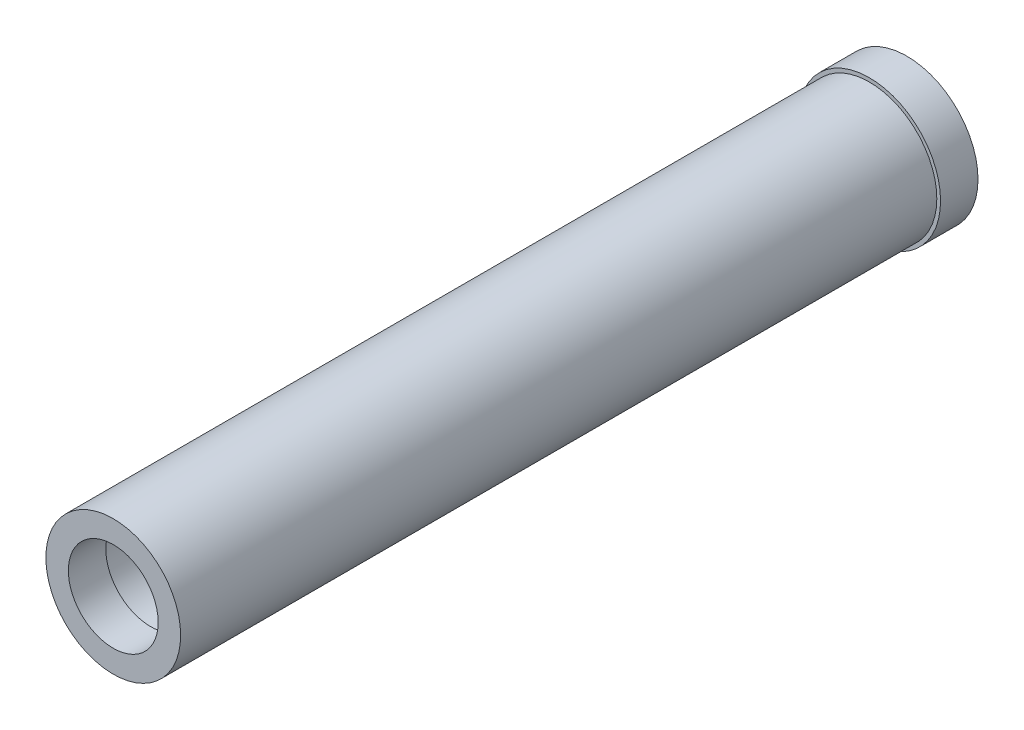
ISO-10303-21;
HEADER;
FILE_DESCRIPTION(('STEP AP214'),'2;1');
FILE_NAME('part.step','',(''),(''),'','','');
FILE_SCHEMA(('AUTOMOTIVE_DESIGN { 1 0 10303 214 1 1 1 1 }'));
ENDSEC;
DATA;
#1=APPLICATION_CONTEXT('core data for automotive mechanical design processes');
#2=APPLICATION_PROTOCOL_DEFINITION('international standard','automotive_design',2000,#1);
#3=PRODUCT_CONTEXT('',#1,'mechanical');
#4=PRODUCT('Part','Part','',(#3));
#5=PRODUCT_RELATED_PRODUCT_CATEGORY('part','',(#4));
#6=PRODUCT_DEFINITION_FORMATION('','',#4);
#7=PRODUCT_DEFINITION_CONTEXT('part definition',#1,'design');
#8=PRODUCT_DEFINITION('design','',#6,#7);
#9=PRODUCT_DEFINITION_SHAPE('','',#8);
#10=(LENGTH_UNIT() NAMED_UNIT(*) SI_UNIT(.MILLI.,.METRE.));
#11=(NAMED_UNIT(*) PLANE_ANGLE_UNIT() SI_UNIT($,.RADIAN.));
#12=(NAMED_UNIT(*) SI_UNIT($,.STERADIAN.) SOLID_ANGLE_UNIT());
#13=UNCERTAINTY_MEASURE_WITH_UNIT(LENGTH_MEASURE(1.E-05),#10,'distance_accuracy_value','');
#14=(GEOMETRIC_REPRESENTATION_CONTEXT(3) GLOBAL_UNCERTAINTY_ASSIGNED_CONTEXT((#13)) GLOBAL_UNIT_ASSIGNED_CONTEXT((#10,
#11,#12)) REPRESENTATION_CONTEXT('',''));
#15=CARTESIAN_POINT('',(0.,0.,0.));
#16=DIRECTION('',(0.,0.,1.));
#17=DIRECTION('',(1.,0.,0.));
#18=AXIS2_PLACEMENT_3D('',#15,#16,#17);
#19=CARTESIAN_POINT('',(0.,-41.9414213562373,10.));
#20=DIRECTION('',(0.,0.,1.));
#21=DIRECTION('',(1.,0.,0.));
#22=AXIS2_PLACEMENT_3D('',#19,#20,#21);
#23=PLANE('',#22);
#24=CARTESIAN_POINT('',(0.,0.,10.));
#25=DIRECTION('',(0.,0.,1.));
#26=DIRECTION('',(1.,0.,0.));
#27=AXIS2_PLACEMENT_3D('',#24,#25,#26);
#28=CIRCLE('',#27,19.);
#29=CARTESIAN_POINT('',(19.,0.,10.));
#30=VERTEX_POINT('',#29);
#31=EDGE_CURVE('E37',#30,#30,#28,.T.);
#32=ORIENTED_EDGE('',*,*,#31,.T.);
#33=EDGE_LOOP('',(#32));
#34=FACE_BOUND('',#33,.T.);
#35=CARTESIAN_POINT('',(0.,0.,10.));
#36=DIRECTION('',(0.,0.,1.));
#37=DIRECTION('',(1.,0.,0.));
#38=AXIS2_PLACEMENT_3D('',#35,#36,#37);
#39=CIRCLE('',#38,18.);
#40=CARTESIAN_POINT('',(18.,0.,10.));
#41=VERTEX_POINT('',#40);
#42=EDGE_CURVE('E46',#41,#41,#39,.F.);
#43=ORIENTED_EDGE('',*,*,#42,.T.);
#44=EDGE_LOOP('',(#43));
#45=FACE_BOUND('',#44,.T.);
#46=ADVANCED_FACE('F30',(#34,#45),#23,.T.);
#47=CARTESIAN_POINT('',(0.,0.,10.));
#48=DIRECTION('',(0.,0.,-1.));
#49=DIRECTION('',(-1.,0.,0.));
#50=AXIS2_PLACEMENT_3D('',#47,#48,#49);
#51=CYLINDRICAL_SURFACE('',#50,19.);
#52=ORIENTED_EDGE('',*,*,#31,.F.);
#53=EDGE_LOOP('',(#52));
#54=FACE_BOUND('',#53,.T.);
#55=CARTESIAN_POINT('',(0.,0.,0.));
#56=DIRECTION('',(0.,0.,1.));
#57=DIRECTION('',(1.,0.,0.));
#58=AXIS2_PLACEMENT_3D('',#55,#56,#57);
#59=CIRCLE('',#58,19.);
#60=CARTESIAN_POINT('',(19.,0.,0.));
#61=VERTEX_POINT('',#60);
#62=EDGE_CURVE('E41',#61,#61,#59,.T.);
#63=ORIENTED_EDGE('',*,*,#62,.T.);
#64=EDGE_LOOP('',(#63));
#65=FACE_BOUND('',#64,.T.);
#66=ADVANCED_FACE('F32',(#54,#65),#51,.T.);
#67=CARTESIAN_POINT('',(0.,-41.9414213562373,0.));
#68=DIRECTION('',(0.,0.,1.));
#69=DIRECTION('',(1.,0.,0.));
#70=AXIS2_PLACEMENT_3D('',#67,#68,#69);
#71=PLANE('',#70);
#72=ORIENTED_EDGE('',*,*,#62,.F.);
#73=EDGE_LOOP('',(#72));
#74=FACE_BOUND('',#73,.T.);
#75=ADVANCED_FACE('F82',(#74),#71,.F.);
#76=CARTESIAN_POINT('',(0.,0.,212.));
#77=DIRECTION('',(0.,0.,-1.));
#78=DIRECTION('',(-1.,0.,0.));
#79=AXIS2_PLACEMENT_3D('',#76,#77,#78);
#80=CYLINDRICAL_SURFACE('',#79,18.);
#81=ORIENTED_EDGE('',*,*,#42,.F.);
#82=EDGE_LOOP('',(#81));
#83=FACE_BOUND('',#82,.T.);
#84=CARTESIAN_POINT('',(0.,0.,212.));
#85=DIRECTION('',(0.,0.,1.));
#86=DIRECTION('',(1.,0.,0.));
#87=AXIS2_PLACEMENT_3D('',#84,#85,#86);
#88=CIRCLE('',#87,18.);
#89=CARTESIAN_POINT('',(18.,0.,212.));
#90=VERTEX_POINT('',#89);
#91=EDGE_CURVE('E50',#90,#90,#88,.T.);
#92=ORIENTED_EDGE('',*,*,#91,.F.);
#93=EDGE_LOOP('',(#92));
#94=FACE_BOUND('',#93,.T.);
#95=ADVANCED_FACE('F74',(#83,#94),#80,.T.);
#96=CARTESIAN_POINT('',(0.,-41.9414213562373,212.));
#97=DIRECTION('',(0.,0.,1.));
#98=DIRECTION('',(1.,0.,0.));
#99=AXIS2_PLACEMENT_3D('',#96,#97,#98);
#100=PLANE('',#99);
#101=ORIENTED_EDGE('',*,*,#91,.T.);
#102=EDGE_LOOP('',(#101));
#103=FACE_BOUND('',#102,.T.);
#104=CARTESIAN_POINT('',(0.,0.,212.));
#105=DIRECTION('',(0.,0.,1.));
#106=DIRECTION('',(1.,0.,0.));
#107=AXIS2_PLACEMENT_3D('',#104,#105,#106);
#108=CIRCLE('',#107,12.);
#109=CARTESIAN_POINT('',(12.,0.,212.));
#110=VERTEX_POINT('',#109);
#111=EDGE_CURVE('E57',#110,#110,#108,.T.);
#112=ORIENTED_EDGE('',*,*,#111,.F.);
#113=EDGE_LOOP('',(#112));
#114=FACE_BOUND('',#113,.T.);
#115=ADVANCED_FACE('F72',(#103,#114),#100,.T.);
#116=CARTESIAN_POINT('',(0.,0.,202.));
#117=DIRECTION('',(0.,0.,1.));
#118=DIRECTION('',(1.,0.,0.));
#119=AXIS2_PLACEMENT_3D('',#116,#117,#118);
#120=PLANE('',#119);
#121=CARTESIAN_POINT('',(0.,0.,202.));
#122=DIRECTION('',(0.,0.,1.));
#123=DIRECTION('',(1.,0.,0.));
#124=AXIS2_PLACEMENT_3D('',#121,#122,#123);
#125=CIRCLE('',#124,12.);
#126=CARTESIAN_POINT('',(12.,0.,202.));
#127=VERTEX_POINT('',#126);
#128=EDGE_CURVE('E56',#127,#127,#125,.T.);
#129=ORIENTED_EDGE('',*,*,#128,.T.);
#130=EDGE_LOOP('',(#129));
#131=FACE_BOUND('',#130,.T.);
#132=CARTESIAN_POINT('',(0.,0.,202.));
#133=DIRECTION('',(0.,0.,1.));
#134=DIRECTION('',(1.,0.,0.));
#135=AXIS2_PLACEMENT_3D('',#132,#133,#134);
#136=CIRCLE('',#135,13.);
#137=CARTESIAN_POINT('',(13.,0.,202.));
#138=VERTEX_POINT('',#137);
#139=EDGE_CURVE('E10',#138,#138,#136,.F.);
#140=ORIENTED_EDGE('',*,*,#139,.T.);
#141=EDGE_LOOP('',(#140));
#142=FACE_BOUND('',#141,.T.);
#143=ADVANCED_FACE('F63',(#131,#142),#120,.F.);
#144=CARTESIAN_POINT('',(0.,0.,202.));
#145=DIRECTION('',(0.,0.,1.));
#146=DIRECTION('',(1.,0.,0.));
#147=AXIS2_PLACEMENT_3D('',#144,#145,#146);
#148=CYLINDRICAL_SURFACE('',#147,12.);
#149=ORIENTED_EDGE('',*,*,#128,.F.);
#150=EDGE_LOOP('',(#149));
#151=FACE_BOUND('',#150,.T.);
#152=ORIENTED_EDGE('',*,*,#111,.T.);
#153=EDGE_LOOP('',(#152));
#154=FACE_BOUND('',#153,.T.);
#155=ADVANCED_FACE('F65',(#151,#154),#148,.F.);
#156=CARTESIAN_POINT('',(0.,0.,12.));
#157=DIRECTION('',(0.,0.,1.));
#158=DIRECTION('',(1.,0.,0.));
#159=AXIS2_PLACEMENT_3D('',#156,#157,#158);
#160=PLANE('',#159);
#161=CARTESIAN_POINT('',(0.,0.,12.));
#162=DIRECTION('',(0.,0.,1.));
#163=DIRECTION('',(1.,0.,0.));
#164=AXIS2_PLACEMENT_3D('',#161,#162,#163);
#165=CIRCLE('',#164,13.);
#166=CARTESIAN_POINT('',(13.,0.,12.));
#167=VERTEX_POINT('',#166);
#168=EDGE_CURVE('E53',#167,#167,#165,.T.);
#169=ORIENTED_EDGE('',*,*,#168,.T.);
#170=EDGE_LOOP('',(#169));
#171=FACE_BOUND('',#170,.T.);
#172=ADVANCED_FACE('F68',(#171),#160,.T.);
#173=CARTESIAN_POINT('',(0.,0.,12.));
#174=DIRECTION('',(0.,0.,1.));
#175=DIRECTION('',(1.,0.,0.));
#176=AXIS2_PLACEMENT_3D('',#173,#174,#175);
#177=CYLINDRICAL_SURFACE('',#176,13.);
#178=ORIENTED_EDGE('',*,*,#168,.F.);
#179=EDGE_LOOP('',(#178));
#180=FACE_BOUND('',#179,.T.);
#181=ORIENTED_EDGE('',*,*,#139,.F.);
#182=EDGE_LOOP('',(#181));
#183=FACE_BOUND('',#182,.T.);
#184=ADVANCED_FACE('F115',(#180,#183),#177,.F.);
#185=CLOSED_SHELL('',(#46,#66,#75,#95,#115,#143,#155,#172,#184));
#186=MANIFOLD_SOLID_BREP('B2',#185);
#187=ADVANCED_BREP_SHAPE_REPRESENTATION('',(#18,#186),#14);
#188=SHAPE_DEFINITION_REPRESENTATION(#9,#187);
ENDSEC;
END-ISO-10303-21;
